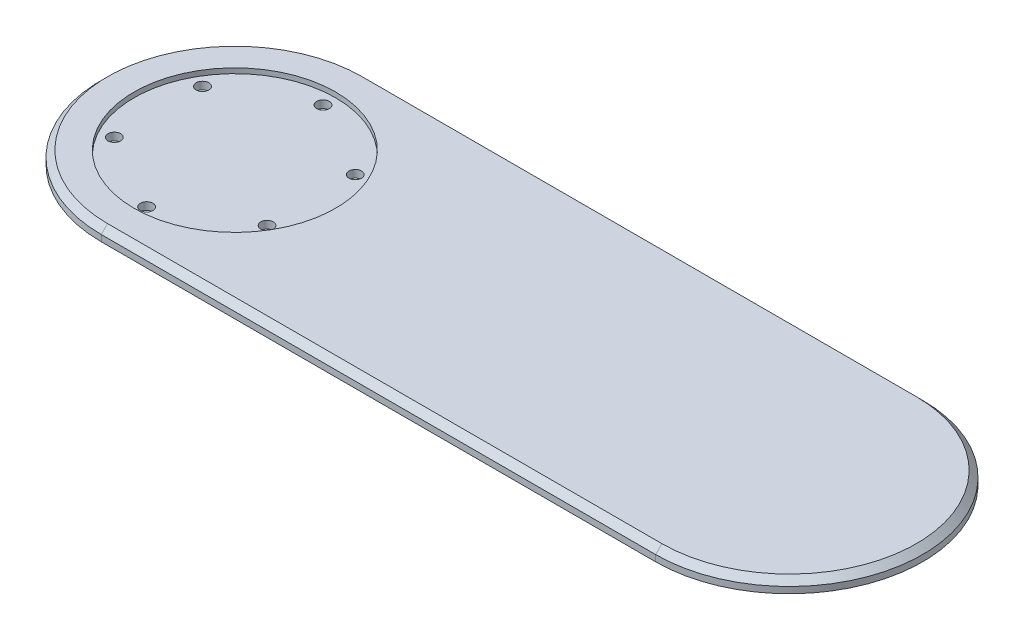
ISO-10303-21;
HEADER;
FILE_DESCRIPTION(('STEP AP214'),'2;1');
FILE_NAME('part.step','',(''),(''),'','','');
FILE_SCHEMA(('AUTOMOTIVE_DESIGN { 1 0 10303 214 1 1 1 1 }'));
ENDSEC;
DATA;
#1=APPLICATION_CONTEXT('core data for automotive mechanical design processes');
#2=APPLICATION_PROTOCOL_DEFINITION('international standard','automotive_design',2000,#1);
#3=PRODUCT_CONTEXT('',#1,'mechanical');
#4=PRODUCT('Part','Part','',(#3));
#5=PRODUCT_RELATED_PRODUCT_CATEGORY('part','',(#4));
#6=PRODUCT_DEFINITION_FORMATION('','',#4);
#7=PRODUCT_DEFINITION_CONTEXT('part definition',#1,'design');
#8=PRODUCT_DEFINITION('design','',#6,#7);
#9=PRODUCT_DEFINITION_SHAPE('','',#8);
#10=(LENGTH_UNIT() NAMED_UNIT(*) SI_UNIT(.MILLI.,.METRE.));
#11=(NAMED_UNIT(*) PLANE_ANGLE_UNIT() SI_UNIT($,.RADIAN.));
#12=(NAMED_UNIT(*) SI_UNIT($,.STERADIAN.) SOLID_ANGLE_UNIT());
#13=UNCERTAINTY_MEASURE_WITH_UNIT(LENGTH_MEASURE(1.E-05),#10,'distance_accuracy_value','');
#14=(GEOMETRIC_REPRESENTATION_CONTEXT(3) GLOBAL_UNCERTAINTY_ASSIGNED_CONTEXT((#13)) GLOBAL_UNIT_ASSIGNED_CONTEXT((#10,
#11,#12)) REPRESENTATION_CONTEXT('',''));
#15=CARTESIAN_POINT('',(0.,0.,0.));
#16=DIRECTION('',(0.,0.,1.));
#17=DIRECTION('',(1.,0.,0.));
#18=AXIS2_PLACEMENT_3D('',#15,#16,#17);
#19=CARTESIAN_POINT('',(-79.689110867544,5.,17.4999999999997));
#20=DIRECTION('',(0.,-1.,0.));
#21=DIRECTION('',(0.,0.,-1.));
#22=AXIS2_PLACEMENT_3D('',#19,#20,#21);
#23=CYLINDRICAL_SURFACE('',#22,2.5);
#24=CARTESIAN_POINT('',(-79.689110867544,0.,17.4999999999997));
#25=DIRECTION('',(0.,1.,0.));
#26=DIRECTION('',(0.,0.,1.));
#27=AXIS2_PLACEMENT_3D('',#24,#25,#26);
#28=CIRCLE('',#27,2.5);
#29=CARTESIAN_POINT('',(-79.689110867544,0.,19.9999999999997));
#30=VERTEX_POINT('',#29);
#31=EDGE_CURVE('E129',#30,#30,#28,.T.);
#32=ORIENTED_EDGE('',*,*,#31,.F.);
#33=EDGE_LOOP('',(#32));
#34=FACE_BOUND('',#33,.T.);
#35=CARTESIAN_POINT('',(-79.689110867544,3.,17.4999999999997));
#36=DIRECTION('',(0.,1.,0.));
#37=DIRECTION('',(0.,0.,1.));
#38=AXIS2_PLACEMENT_3D('',#35,#36,#37);
#39=CIRCLE('',#38,2.5);
#40=CARTESIAN_POINT('',(-79.689110867544,3.,19.9999999999997));
#41=VERTEX_POINT('',#40);
#42=EDGE_CURVE('E113',#41,#41,#39,.T.);
#43=ORIENTED_EDGE('',*,*,#42,.T.);
#44=EDGE_LOOP('',(#43));
#45=FACE_BOUND('',#44,.T.);
#46=ADVANCED_FACE('F37',(#34,#45),#23,.F.);
#47=CARTESIAN_POINT('',(-109.999999999999,5.,35.));
#48=DIRECTION('',(0.,-1.,0.));
#49=DIRECTION('',(0.,0.,-1.));
#50=AXIS2_PLACEMENT_3D('',#47,#48,#49);
#51=CYLINDRICAL_SURFACE('',#50,2.5);
#52=CARTESIAN_POINT('',(-109.999999999999,0.,35.));
#53=DIRECTION('',(0.,1.,0.));
#54=DIRECTION('',(0.,0.,1.));
#55=AXIS2_PLACEMENT_3D('',#52,#53,#54);
#56=CIRCLE('',#55,2.5);
#57=CARTESIAN_POINT('',(-109.999999999999,0.,37.5));
#58=VERTEX_POINT('',#57);
#59=EDGE_CURVE('E126',#58,#58,#56,.T.);
#60=ORIENTED_EDGE('',*,*,#59,.F.);
#61=EDGE_LOOP('',(#60));
#62=FACE_BOUND('',#61,.T.);
#63=CARTESIAN_POINT('',(-109.999999999999,3.,35.));
#64=DIRECTION('',(0.,1.,0.));
#65=DIRECTION('',(0.,0.,1.));
#66=AXIS2_PLACEMENT_3D('',#63,#64,#65);
#67=CIRCLE('',#66,2.5);
#68=CARTESIAN_POINT('',(-109.999999999999,3.,37.5));
#69=VERTEX_POINT('',#68);
#70=EDGE_CURVE('E187',#69,#69,#67,.T.);
#71=ORIENTED_EDGE('',*,*,#70,.T.);
#72=EDGE_LOOP('',(#71));
#73=FACE_BOUND('',#72,.T.);
#74=ADVANCED_FACE('F220',(#62,#73),#51,.F.);
#75=CARTESIAN_POINT('',(-140.310889132455,5.,17.5000000000001));
#76=DIRECTION('',(0.,-1.,0.));
#77=DIRECTION('',(0.,0.,-1.));
#78=AXIS2_PLACEMENT_3D('',#75,#76,#77);
#79=CYLINDRICAL_SURFACE('',#78,2.50000000000001);
#80=CARTESIAN_POINT('',(-140.310889132455,0.,17.5000000000001));
#81=DIRECTION('',(0.,1.,0.));
#82=DIRECTION('',(0.,0.,1.));
#83=AXIS2_PLACEMENT_3D('',#80,#81,#82);
#84=CIRCLE('',#83,2.50000000000001);
#85=CARTESIAN_POINT('',(-140.310889132455,0.,20.0000000000002));
#86=VERTEX_POINT('',#85);
#87=EDGE_CURVE('E123',#86,#86,#84,.T.);
#88=ORIENTED_EDGE('',*,*,#87,.F.);
#89=EDGE_LOOP('',(#88));
#90=FACE_BOUND('',#89,.T.);
#91=CARTESIAN_POINT('',(-140.310889132455,3.,17.5000000000001));
#92=DIRECTION('',(0.,1.,0.));
#93=DIRECTION('',(0.,0.,1.));
#94=AXIS2_PLACEMENT_3D('',#91,#92,#93);
#95=CIRCLE('',#94,2.50000000000001);
#96=CARTESIAN_POINT('',(-140.310889132455,3.,20.0000000000002));
#97=VERTEX_POINT('',#96);
#98=EDGE_CURVE('E184',#97,#97,#95,.T.);
#99=ORIENTED_EDGE('',*,*,#98,.T.);
#100=EDGE_LOOP('',(#99));
#101=FACE_BOUND('',#100,.T.);
#102=ADVANCED_FACE('F226',(#90,#101),#79,.F.);
#103=CARTESIAN_POINT('',(-140.310889132455,5.,-17.5));
#104=DIRECTION('',(0.,-1.,0.));
#105=DIRECTION('',(0.,0.,-1.));
#106=AXIS2_PLACEMENT_3D('',#103,#104,#105);
#107=CYLINDRICAL_SURFACE('',#106,2.50000000000001);
#108=CARTESIAN_POINT('',(-140.310889132455,0.,-17.5));
#109=DIRECTION('',(0.,1.,0.));
#110=DIRECTION('',(0.,0.,1.));
#111=AXIS2_PLACEMENT_3D('',#108,#109,#110);
#112=CIRCLE('',#111,2.50000000000001);
#113=CARTESIAN_POINT('',(-140.310889132455,0.,-15.));
#114=VERTEX_POINT('',#113);
#115=EDGE_CURVE('E120',#114,#114,#112,.T.);
#116=ORIENTED_EDGE('',*,*,#115,.F.);
#117=EDGE_LOOP('',(#116));
#118=FACE_BOUND('',#117,.T.);
#119=CARTESIAN_POINT('',(-140.310889132455,3.,-17.5));
#120=DIRECTION('',(0.,1.,0.));
#121=DIRECTION('',(0.,0.,1.));
#122=AXIS2_PLACEMENT_3D('',#119,#120,#121);
#123=CIRCLE('',#122,2.50000000000001);
#124=CARTESIAN_POINT('',(-140.310889132455,3.,-15.));
#125=VERTEX_POINT('',#124);
#126=EDGE_CURVE('E181',#125,#125,#123,.T.);
#127=ORIENTED_EDGE('',*,*,#126,.T.);
#128=EDGE_LOOP('',(#127));
#129=FACE_BOUND('',#128,.T.);
#130=ADVANCED_FACE('F235',(#118,#129),#107,.F.);
#131=CARTESIAN_POINT('',(-110.,5.,-35.));
#132=DIRECTION('',(0.,-1.,0.));
#133=DIRECTION('',(0.,0.,-1.));
#134=AXIS2_PLACEMENT_3D('',#131,#132,#133);
#135=CYLINDRICAL_SURFACE('',#134,2.50000000000001);
#136=CARTESIAN_POINT('',(-110.,0.,-35.));
#137=DIRECTION('',(0.,1.,0.));
#138=DIRECTION('',(0.,0.,1.));
#139=AXIS2_PLACEMENT_3D('',#136,#137,#138);
#140=CIRCLE('',#139,2.50000000000001);
#141=CARTESIAN_POINT('',(-110.,0.,-32.5));
#142=VERTEX_POINT('',#141);
#143=EDGE_CURVE('E110',#142,#142,#140,.T.);
#144=ORIENTED_EDGE('',*,*,#143,.F.);
#145=EDGE_LOOP('',(#144));
#146=FACE_BOUND('',#145,.T.);
#147=CARTESIAN_POINT('',(-110.,3.,-35.));
#148=DIRECTION('',(0.,1.,0.));
#149=DIRECTION('',(0.,0.,1.));
#150=AXIS2_PLACEMENT_3D('',#147,#148,#149);
#151=CIRCLE('',#150,2.50000000000001);
#152=CARTESIAN_POINT('',(-110.,3.,-32.5));
#153=VERTEX_POINT('',#152);
#154=EDGE_CURVE('E142',#153,#153,#151,.T.);
#155=ORIENTED_EDGE('',*,*,#154,.T.);
#156=EDGE_LOOP('',(#155));
#157=FACE_BOUND('',#156,.T.);
#158=ADVANCED_FACE('F239',(#146,#157),#135,.F.);
#159=CARTESIAN_POINT('',(-79.6891108675443,5.,-17.5000000000004));
#160=DIRECTION('',(0.,-1.,0.));
#161=DIRECTION('',(0.,0.,-1.));
#162=AXIS2_PLACEMENT_3D('',#159,#160,#161);
#163=CYLINDRICAL_SURFACE('',#162,2.5);
#164=CARTESIAN_POINT('',(-79.6891108675443,0.,-17.5000000000004));
#165=DIRECTION('',(0.,1.,0.));
#166=DIRECTION('',(0.,0.,1.));
#167=AXIS2_PLACEMENT_3D('',#164,#165,#166);
#168=CIRCLE('',#167,2.5);
#169=CARTESIAN_POINT('',(-79.6891108675443,0.,-15.0000000000004));
#170=VERTEX_POINT('',#169);
#171=EDGE_CURVE('E132',#170,#170,#168,.T.);
#172=ORIENTED_EDGE('',*,*,#171,.F.);
#173=EDGE_LOOP('',(#172));
#174=FACE_BOUND('',#173,.T.);
#175=CARTESIAN_POINT('',(-79.6891108675443,3.,-17.5000000000004));
#176=DIRECTION('',(0.,1.,0.));
#177=DIRECTION('',(0.,0.,1.));
#178=AXIS2_PLACEMENT_3D('',#175,#176,#177);
#179=CIRCLE('',#178,2.5);
#180=CARTESIAN_POINT('',(-79.6891108675443,3.,-15.0000000000004));
#181=VERTEX_POINT('',#180);
#182=EDGE_CURVE('E139',#181,#181,#179,.T.);
#183=ORIENTED_EDGE('',*,*,#182,.T.);
#184=EDGE_LOOP('',(#183));
#185=FACE_BOUND('',#184,.T.);
#186=ADVANCED_FACE('F231',(#174,#185),#163,.F.);
#187=CARTESIAN_POINT('',(-110.,5.,0.));
#188=DIRECTION('',(0.,-1.,0.));
#189=DIRECTION('',(0.,0.,-1.));
#190=AXIS2_PLACEMENT_3D('',#187,#188,#189);
#191=CYLINDRICAL_SURFACE('',#190,53.);
#192=DIRECTION('',(0.,-1.,0.));
#193=VECTOR('',#192,1.);
#194=CARTESIAN_POINT('',(-110.,5.,53.));
#195=LINE('',#194,#193);
#196=CARTESIAN_POINT('',(-110.,2.49999999999997,53.));
#197=VERTEX_POINT('',#196);
#198=CARTESIAN_POINT('',(-110.,0.,53.));
#199=VERTEX_POINT('',#198);
#200=EDGE_CURVE('E89',#197,#199,#195,.T.);
#201=ORIENTED_EDGE('',*,*,#200,.F.);
#202=CARTESIAN_POINT('',(-110.,2.49999999999997,0.));
#203=DIRECTION('',(0.,1.,0.));
#204=DIRECTION('',(0.,0.,1.));
#205=AXIS2_PLACEMENT_3D('',#202,#203,#204);
#206=CIRCLE('',#205,53.);
#207=CARTESIAN_POINT('',(-110.,2.49999999999997,-53.));
#208=VERTEX_POINT('',#207);
#209=EDGE_CURVE('E47',#197,#208,#206,.F.);
#210=ORIENTED_EDGE('',*,*,#209,.T.);
#211=DIRECTION('',(0.,-1.,0.));
#212=VECTOR('',#211,1.);
#213=CARTESIAN_POINT('',(-110.,5.,-53.));
#214=LINE('',#213,#212);
#215=CARTESIAN_POINT('',(-110.,0.,-53.));
#216=VERTEX_POINT('',#215);
#217=EDGE_CURVE('E109',#208,#216,#214,.T.);
#218=ORIENTED_EDGE('',*,*,#217,.T.);
#219=CARTESIAN_POINT('',(-110.,0.,0.));
#220=DIRECTION('',(0.,1.,0.));
#221=DIRECTION('',(0.,0.,1.));
#222=AXIS2_PLACEMENT_3D('',#219,#220,#221);
#223=CIRCLE('',#222,53.);
#224=EDGE_CURVE('E103',#216,#199,#223,.T.);
#225=ORIENTED_EDGE('',*,*,#224,.T.);
#226=EDGE_LOOP('',(#201,#210,#218,#225));
#227=FACE_BOUND('',#226,.T.);
#228=ADVANCED_FACE('F108',(#227),#191,.T.);
#229=CARTESIAN_POINT('',(0.,5.,53.));
#230=DIRECTION('',(0.,0.,-1.));
#231=DIRECTION('',(-1.,0.,0.));
#232=AXIS2_PLACEMENT_3D('',#229,#230,#231);
#233=PLANE('',#232);
#234=DIRECTION('',(0.,-1.,0.));
#235=VECTOR('',#234,1.);
#236=CARTESIAN_POINT('',(110.,5.,53.));
#237=LINE('',#236,#235);
#238=CARTESIAN_POINT('',(110.,2.49999999999997,53.));
#239=VERTEX_POINT('',#238);
#240=CARTESIAN_POINT('',(110.,0.,53.));
#241=VERTEX_POINT('',#240);
#242=EDGE_CURVE('E96',#239,#241,#237,.T.);
#243=ORIENTED_EDGE('',*,*,#242,.F.);
#244=DIRECTION('',(-1.,0.,0.));
#245=VECTOR('',#244,1.);
#246=CARTESIAN_POINT('',(-110.,2.49999999999997,53.));
#247=LINE('',#246,#245);
#248=EDGE_CURVE('E11',#239,#197,#247,.T.);
#249=ORIENTED_EDGE('',*,*,#248,.T.);
#250=ORIENTED_EDGE('',*,*,#200,.T.);
#251=DIRECTION('',(1.,0.,0.));
#252=VECTOR('',#251,1.);
#253=CARTESIAN_POINT('',(0.,0.,53.));
#254=LINE('',#253,#252);
#255=EDGE_CURVE('E92',#199,#241,#254,.T.);
#256=ORIENTED_EDGE('',*,*,#255,.T.);
#257=EDGE_LOOP('',(#243,#249,#250,#256));
#258=FACE_BOUND('',#257,.T.);
#259=ADVANCED_FACE('F91',(#258),#233,.F.);
#260=CARTESIAN_POINT('',(110.,5.,0.));
#261=DIRECTION('',(0.,-1.,0.));
#262=DIRECTION('',(0.,0.,-1.));
#263=AXIS2_PLACEMENT_3D('',#260,#261,#262);
#264=CYLINDRICAL_SURFACE('',#263,53.);
#265=DIRECTION('',(0.,-1.,0.));
#266=VECTOR('',#265,1.);
#267=CARTESIAN_POINT('',(110.,5.,-53.));
#268=LINE('',#267,#266);
#269=CARTESIAN_POINT('',(110.,2.49999999999997,-53.));
#270=VERTEX_POINT('',#269);
#271=CARTESIAN_POINT('',(110.,0.,-53.));
#272=VERTEX_POINT('',#271);
#273=EDGE_CURVE('E136',#270,#272,#268,.T.);
#274=ORIENTED_EDGE('',*,*,#273,.F.);
#275=CARTESIAN_POINT('',(110.,2.49999999999997,0.));
#276=DIRECTION('',(0.,1.,0.));
#277=DIRECTION('',(0.,0.,1.));
#278=AXIS2_PLACEMENT_3D('',#275,#276,#277);
#279=CIRCLE('',#278,53.);
#280=EDGE_CURVE('E152',#270,#239,#279,.F.);
#281=ORIENTED_EDGE('',*,*,#280,.T.);
#282=ORIENTED_EDGE('',*,*,#242,.T.);
#283=CARTESIAN_POINT('',(110.,0.,0.));
#284=DIRECTION('',(0.,1.,0.));
#285=DIRECTION('',(0.,0.,1.));
#286=AXIS2_PLACEMENT_3D('',#283,#284,#285);
#287=CIRCLE('',#286,53.);
#288=EDGE_CURVE('E106',#241,#272,#287,.T.);
#289=ORIENTED_EDGE('',*,*,#288,.T.);
#290=EDGE_LOOP('',(#274,#281,#282,#289));
#291=FACE_BOUND('',#290,.T.);
#292=ADVANCED_FACE('F244',(#291),#264,.T.);
#293=CARTESIAN_POINT('',(0.,5.,-53.));
#294=DIRECTION('',(0.,0.,-1.));
#295=DIRECTION('',(-1.,0.,0.));
#296=AXIS2_PLACEMENT_3D('',#293,#294,#295);
#297=PLANE('',#296);
#298=ORIENTED_EDGE('',*,*,#217,.F.);
#299=DIRECTION('',(1.,0.,0.));
#300=VECTOR('',#299,1.);
#301=CARTESIAN_POINT('',(0.,2.49999999999997,-53.));
#302=LINE('',#301,#300);
#303=EDGE_CURVE('E155',#208,#270,#302,.T.);
#304=ORIENTED_EDGE('',*,*,#303,.T.);
#305=ORIENTED_EDGE('',*,*,#273,.T.);
#306=DIRECTION('',(1.,0.,0.));
#307=VECTOR('',#306,1.);
#308=CARTESIAN_POINT('',(0.,0.,-53.));
#309=LINE('',#308,#307);
#310=EDGE_CURVE('E118',#216,#272,#309,.T.);
#311=ORIENTED_EDGE('',*,*,#310,.F.);
#312=EDGE_LOOP('',(#298,#304,#305,#311));
#313=FACE_BOUND('',#312,.T.);
#314=ADVANCED_FACE('F241',(#313),#297,.T.);
#315=CARTESIAN_POINT('',(0.,5.,0.));
#316=DIRECTION('',(0.,1.,0.));
#317=DIRECTION('',(0.,0.,1.));
#318=AXIS2_PLACEMENT_3D('',#315,#316,#317);
#319=PLANE('',#318);
#320=DIRECTION('',(1.,0.,0.));
#321=VECTOR('',#320,1.);
#322=CARTESIAN_POINT('',(110.,5.,50.4999999999999));
#323=LINE('',#322,#321);
#324=CARTESIAN_POINT('',(-110.,5.,50.4999999999999));
#325=VERTEX_POINT('',#324);
#326=CARTESIAN_POINT('',(110.,5.,50.4999999999999));
#327=VERTEX_POINT('',#326);
#328=EDGE_CURVE('E95',#325,#327,#323,.T.);
#329=ORIENTED_EDGE('',*,*,#328,.T.);
#330=CARTESIAN_POINT('',(110.,5.,0.));
#331=DIRECTION('',(0.,1.,0.));
#332=DIRECTION('',(0.,0.,1.));
#333=AXIS2_PLACEMENT_3D('',#330,#331,#332);
#334=CIRCLE('',#333,50.4999999999999);
#335=CARTESIAN_POINT('',(110.,5.,-50.5));
#336=VERTEX_POINT('',#335);
#337=EDGE_CURVE('E149',#327,#336,#334,.T.);
#338=ORIENTED_EDGE('',*,*,#337,.T.);
#339=DIRECTION('',(-1.,0.,0.));
#340=VECTOR('',#339,1.);
#341=CARTESIAN_POINT('',(0.,5.,-50.5));
#342=LINE('',#341,#340);
#343=CARTESIAN_POINT('',(-110.,5.,-50.5));
#344=VERTEX_POINT('',#343);
#345=EDGE_CURVE('E147',#336,#344,#342,.T.);
#346=ORIENTED_EDGE('',*,*,#345,.T.);
#347=CARTESIAN_POINT('',(-110.,5.,0.));
#348=DIRECTION('',(0.,1.,0.));
#349=DIRECTION('',(0.,0.,1.));
#350=AXIS2_PLACEMENT_3D('',#347,#348,#349);
#351=CIRCLE('',#350,50.5);
#352=EDGE_CURVE('E145',#344,#325,#351,.T.);
#353=ORIENTED_EDGE('',*,*,#352,.T.);
#354=EDGE_LOOP('',(#329,#338,#346,#353));
#355=FACE_BOUND('',#354,.T.);
#356=CARTESIAN_POINT('',(-109.999999999999,5.,-1.14491749414469E-13));
#357=DIRECTION('',(0.,1.,0.));
#358=DIRECTION('',(0.,0.,1.));
#359=AXIS2_PLACEMENT_3D('',#356,#357,#358);
#360=CIRCLE('',#359,40.);
#361=CARTESIAN_POINT('',(-109.999999999999,5.,39.9999999999999));
#362=VERTEX_POINT('',#361);
#363=EDGE_CURVE('E168',#362,#362,#360,.T.);
#364=ORIENTED_EDGE('',*,*,#363,.F.);
#365=EDGE_LOOP('',(#364));
#366=FACE_BOUND('',#365,.T.);
#367=ADVANCED_FACE('F215',(#355,#366),#319,.T.);
#368=CARTESIAN_POINT('',(0.,0.,0.));
#369=DIRECTION('',(0.,1.,0.));
#370=DIRECTION('',(0.,0.,1.));
#371=AXIS2_PLACEMENT_3D('',#368,#369,#370);
#372=PLANE('',#371);
#373=ORIENTED_EDGE('',*,*,#143,.T.);
#374=EDGE_LOOP('',(#373));
#375=FACE_BOUND('',#374,.T.);
#376=ORIENTED_EDGE('',*,*,#224,.F.);
#377=ORIENTED_EDGE('',*,*,#310,.T.);
#378=ORIENTED_EDGE('',*,*,#288,.F.);
#379=ORIENTED_EDGE('',*,*,#255,.F.);
#380=EDGE_LOOP('',(#376,#377,#378,#379));
#381=FACE_BOUND('',#380,.T.);
#382=ORIENTED_EDGE('',*,*,#115,.T.);
#383=EDGE_LOOP('',(#382));
#384=FACE_BOUND('',#383,.T.);
#385=ORIENTED_EDGE('',*,*,#87,.T.);
#386=EDGE_LOOP('',(#385));
#387=FACE_BOUND('',#386,.T.);
#388=ORIENTED_EDGE('',*,*,#59,.T.);
#389=EDGE_LOOP('',(#388));
#390=FACE_BOUND('',#389,.T.);
#391=ORIENTED_EDGE('',*,*,#31,.T.);
#392=EDGE_LOOP('',(#391));
#393=FACE_BOUND('',#392,.T.);
#394=ORIENTED_EDGE('',*,*,#171,.T.);
#395=EDGE_LOOP('',(#394));
#396=FACE_BOUND('',#395,.T.);
#397=ADVANCED_FACE('F100',(#375,#381,#384,#387,#390,#393,#396),#372,.F.);
#398=CARTESIAN_POINT('',(-109.999999999999,3.,-1.14491749414469E-13));
#399=DIRECTION('',(0.,1.,0.));
#400=DIRECTION('',(0.,0.,1.));
#401=AXIS2_PLACEMENT_3D('',#398,#399,#400);
#402=CYLINDRICAL_SURFACE('',#401,40.);
#403=CARTESIAN_POINT('',(-109.999999999999,3.,-1.14491749414469E-13));
#404=DIRECTION('',(0.,1.,0.));
#405=DIRECTION('',(0.,0.,1.));
#406=AXIS2_PLACEMENT_3D('',#403,#404,#405);
#407=CIRCLE('',#406,40.);
#408=CARTESIAN_POINT('',(-109.999999999999,3.,39.9999999999999));
#409=VERTEX_POINT('',#408);
#410=EDGE_CURVE('E143',#409,#409,#407,.T.);
#411=ORIENTED_EDGE('',*,*,#410,.F.);
#412=EDGE_LOOP('',(#411));
#413=FACE_BOUND('',#412,.T.);
#414=ORIENTED_EDGE('',*,*,#363,.T.);
#415=EDGE_LOOP('',(#414));
#416=FACE_BOUND('',#415,.T.);
#417=ADVANCED_FACE('F196',(#413,#416),#402,.F.);
#418=CARTESIAN_POINT('',(-109.999999999999,3.,-1.14491749414469E-13));
#419=DIRECTION('',(0.,1.,0.));
#420=DIRECTION('',(0.,0.,1.));
#421=AXIS2_PLACEMENT_3D('',#418,#419,#420);
#422=PLANE('',#421);
#423=ORIENTED_EDGE('',*,*,#42,.F.);
#424=EDGE_LOOP('',(#423));
#425=FACE_BOUND('',#424,.T.);
#426=ORIENTED_EDGE('',*,*,#70,.F.);
#427=EDGE_LOOP('',(#426));
#428=FACE_BOUND('',#427,.T.);
#429=ORIENTED_EDGE('',*,*,#98,.F.);
#430=EDGE_LOOP('',(#429));
#431=FACE_BOUND('',#430,.T.);
#432=ORIENTED_EDGE('',*,*,#126,.F.);
#433=EDGE_LOOP('',(#432));
#434=FACE_BOUND('',#433,.T.);
#435=ORIENTED_EDGE('',*,*,#154,.F.);
#436=EDGE_LOOP('',(#435));
#437=FACE_BOUND('',#436,.T.);
#438=ORIENTED_EDGE('',*,*,#182,.F.);
#439=EDGE_LOOP('',(#438));
#440=FACE_BOUND('',#439,.T.);
#441=ORIENTED_EDGE('',*,*,#410,.T.);
#442=EDGE_LOOP('',(#441));
#443=FACE_BOUND('',#442,.T.);
#444=ADVANCED_FACE('F193',(#425,#428,#431,#434,#437,#440,#443),#422,.T.);
#445=CARTESIAN_POINT('',(-110.,5.,0.));
#446=DIRECTION('',(0.,-1.,0.));
#447=DIRECTION('',(0.,0.,-1.));
#448=AXIS2_PLACEMENT_3D('',#445,#446,#447);
#449=CONICAL_SURFACE('',#448,50.5,0.785398163397454);
#450=DIRECTION('',(0.,0.707106781186544,0.707106781186551));
#451=VECTOR('',#450,1.);
#452=CARTESIAN_POINT('',(-110.,2.49999999999997,-53.));
#453=LINE('',#452,#451);
#454=EDGE_CURVE('E161',#208,#344,#453,.T.);
#455=ORIENTED_EDGE('',*,*,#454,.F.);
#456=ORIENTED_EDGE('',*,*,#209,.F.);
#457=DIRECTION('',(0.,-0.707106781186544,0.707106781186551));
#458=VECTOR('',#457,1.);
#459=CARTESIAN_POINT('',(-110.,5.,50.4999999999999));
#460=LINE('',#459,#458);
#461=EDGE_CURVE('E42',#325,#197,#460,.T.);
#462=ORIENTED_EDGE('',*,*,#461,.F.);
#463=ORIENTED_EDGE('',*,*,#352,.F.);
#464=EDGE_LOOP('',(#455,#456,#462,#463));
#465=FACE_BOUND('',#464,.T.);
#466=ADVANCED_FACE('F40',(#465),#449,.T.);
#467=CARTESIAN_POINT('',(0.,5.,50.4999999999999));
#468=DIRECTION('',(0.,0.707106781186551,0.707106781186544));
#469=DIRECTION('',(-1.,0.,0.));
#470=AXIS2_PLACEMENT_3D('',#467,#468,#469);
#471=PLANE('',#470);
#472=ORIENTED_EDGE('',*,*,#461,.T.);
#473=ORIENTED_EDGE('',*,*,#248,.F.);
#474=DIRECTION('',(0.,-0.707106781186544,0.707106781186551));
#475=VECTOR('',#474,1.);
#476=CARTESIAN_POINT('',(110.,5.,50.4999999999999));
#477=LINE('',#476,#475);
#478=EDGE_CURVE('E160',#327,#239,#477,.T.);
#479=ORIENTED_EDGE('',*,*,#478,.F.);
#480=ORIENTED_EDGE('',*,*,#328,.F.);
#481=EDGE_LOOP('',(#472,#473,#479,#480));
#482=FACE_BOUND('',#481,.T.);
#483=ADVANCED_FACE('F269',(#482),#471,.T.);
#484=CARTESIAN_POINT('',(0.,2.49999999999997,-53.));
#485=DIRECTION('',(0.,-0.707106781186551,0.707106781186544));
#486=DIRECTION('',(1.,0.,0.));
#487=AXIS2_PLACEMENT_3D('',#484,#485,#486);
#488=PLANE('',#487);
#489=ORIENTED_EDGE('',*,*,#454,.T.);
#490=ORIENTED_EDGE('',*,*,#345,.F.);
#491=DIRECTION('',(0.,0.707106781186544,0.707106781186551));
#492=VECTOR('',#491,1.);
#493=CARTESIAN_POINT('',(110.,2.49999999999997,-53.));
#494=LINE('',#493,#492);
#495=EDGE_CURVE('E158',#270,#336,#494,.T.);
#496=ORIENTED_EDGE('',*,*,#495,.F.);
#497=ORIENTED_EDGE('',*,*,#303,.F.);
#498=EDGE_LOOP('',(#489,#490,#496,#497));
#499=FACE_BOUND('',#498,.T.);
#500=ADVANCED_FACE('F263',(#499),#488,.F.);
#501=CARTESIAN_POINT('',(110.,5.,0.));
#502=DIRECTION('',(0.,-1.,0.));
#503=DIRECTION('',(0.,0.,-1.));
#504=AXIS2_PLACEMENT_3D('',#501,#502,#503);
#505=CONICAL_SURFACE('',#504,50.4999999999999,0.785398163397454);
#506=ORIENTED_EDGE('',*,*,#478,.T.);
#507=ORIENTED_EDGE('',*,*,#280,.F.);
#508=ORIENTED_EDGE('',*,*,#495,.T.);
#509=ORIENTED_EDGE('',*,*,#337,.F.);
#510=EDGE_LOOP('',(#506,#507,#508,#509));
#511=FACE_BOUND('',#510,.T.);
#512=ADVANCED_FACE('F257',(#511),#505,.T.);
#513=CLOSED_SHELL('',(#46,#74,#102,#130,#158,#186,#228,#259,#292,#314,#367,#397,#417,#444,#466,
#483,#500,#512));
#514=MANIFOLD_SOLID_BREP('B2',#513);
#515=ADVANCED_BREP_SHAPE_REPRESENTATION('',(#18,#514),#14);
#516=SHAPE_DEFINITION_REPRESENTATION(#9,#515);
ENDSEC;
END-ISO-10303-21;
